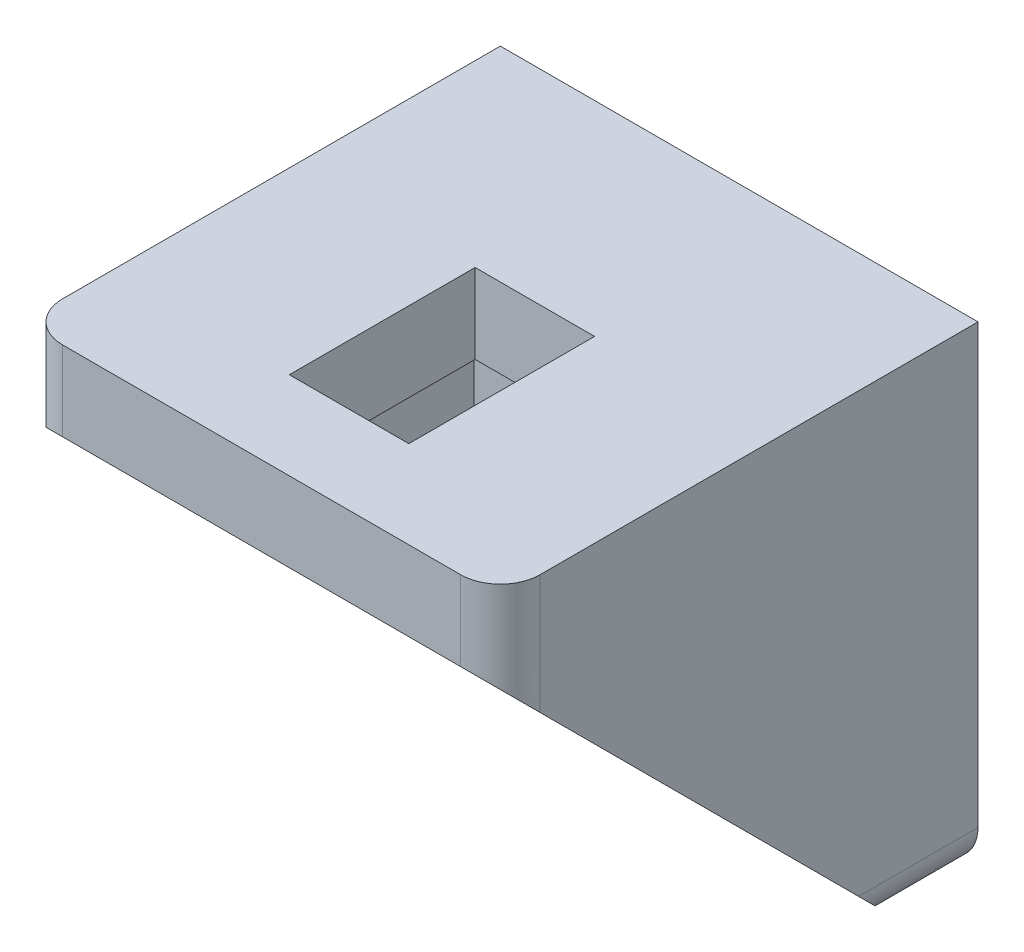
ISO-10303-21;
HEADER;
FILE_DESCRIPTION(('STEP AP214'),'2;1');
FILE_NAME('part.step','',(''),(''),'','','');
FILE_SCHEMA(('AUTOMOTIVE_DESIGN { 1 0 10303 214 1 1 1 1 }'));
ENDSEC;
DATA;
#1=APPLICATION_CONTEXT('core data for automotive mechanical design processes');
#2=APPLICATION_PROTOCOL_DEFINITION('international standard','automotive_design',2000,#1);
#3=PRODUCT_CONTEXT('',#1,'mechanical');
#4=PRODUCT('Part','Part','',(#3));
#5=PRODUCT_RELATED_PRODUCT_CATEGORY('part','',(#4));
#6=PRODUCT_DEFINITION_FORMATION('','',#4);
#7=PRODUCT_DEFINITION_CONTEXT('part definition',#1,'design');
#8=PRODUCT_DEFINITION('design','',#6,#7);
#9=PRODUCT_DEFINITION_SHAPE('','',#8);
#10=(LENGTH_UNIT() NAMED_UNIT(*) SI_UNIT(.MILLI.,.METRE.));
#11=(NAMED_UNIT(*) PLANE_ANGLE_UNIT() SI_UNIT($,.RADIAN.));
#12=(NAMED_UNIT(*) SI_UNIT($,.STERADIAN.) SOLID_ANGLE_UNIT());
#13=UNCERTAINTY_MEASURE_WITH_UNIT(LENGTH_MEASURE(1.E-05),#10,'distance_accuracy_value','');
#14=(GEOMETRIC_REPRESENTATION_CONTEXT(3) GLOBAL_UNCERTAINTY_ASSIGNED_CONTEXT((#13)) GLOBAL_UNIT_ASSIGNED_CONTEXT((#10,
#11,#12)) REPRESENTATION_CONTEXT('',''));
#15=CARTESIAN_POINT('',(0.,0.,0.));
#16=DIRECTION('',(0.,0.,1.));
#17=DIRECTION('',(1.,0.,0.));
#18=AXIS2_PLACEMENT_3D('',#15,#16,#17);
#19=CARTESIAN_POINT('',(7.,0.,0.));
#20=DIRECTION('',(-1.,0.,0.));
#21=DIRECTION('',(0.,-1.,0.));
#22=AXIS2_PLACEMENT_3D('',#19,#20,#21);
#23=PLANE('',#22);
#24=DIRECTION('',(0.,1.,0.));
#25=VECTOR('',#24,1.);
#26=CARTESIAN_POINT('',(7.,-3.,3.));
#27=LINE('',#26,#25);
#28=CARTESIAN_POINT('',(7.,-3.,3.));
#29=VERTEX_POINT('',#28);
#30=CARTESIAN_POINT('',(7.,-18.,3.));
#31=VERTEX_POINT('',#30);
#32=EDGE_CURVE('E268',#29,#31,#27,.F.);
#33=ORIENTED_EDGE('',*,*,#32,.T.);
#34=DIRECTION('',(0.,-0.707106781186548,-0.707106781186548));
#35=VECTOR('',#34,1.);
#36=CARTESIAN_POINT('',(7.,-18.,3.));
#37=LINE('',#36,#35);
#38=CARTESIAN_POINT('',(7.,-3.,18.));
#39=VERTEX_POINT('',#38);
#40=EDGE_CURVE('E207',#39,#31,#37,.T.);
#41=ORIENTED_EDGE('',*,*,#40,.F.);
#42=DIRECTION('',(0.,0.,1.));
#43=VECTOR('',#42,1.);
#44=CARTESIAN_POINT('',(7.,-3.,18.));
#45=LINE('',#44,#43);
#46=EDGE_CURVE('E246',#39,#29,#45,.F.);
#47=ORIENTED_EDGE('',*,*,#46,.T.);
#48=EDGE_LOOP('',(#33,#41,#47));
#49=FACE_BOUND('',#48,.T.);
#50=ADVANCED_FACE('F16',(#49),#23,.T.);
#51=CARTESIAN_POINT('',(-7.,-3.,3.));
#52=DIRECTION('',(0.,0.,-1.));
#53=DIRECTION('',(-1.,0.,0.));
#54=AXIS2_PLACEMENT_3D('',#51,#52,#53);
#55=PLANE('',#54);
#56=DIRECTION('',(0.,-1.,0.));
#57=VECTOR('',#56,1.);
#58=CARTESIAN_POINT('',(-2.25,-7.7,3.));
#59=LINE('',#58,#57);
#60=CARTESIAN_POINT('',(-2.25,-14.7,3.));
#61=VERTEX_POINT('',#60);
#62=CARTESIAN_POINT('',(-2.25,-7.7,3.));
#63=VERTEX_POINT('',#62);
#64=EDGE_CURVE('E358',#61,#63,#59,.F.);
#65=ORIENTED_EDGE('',*,*,#64,.T.);
#66=DIRECTION('',(1.,0.,0.));
#67=VECTOR('',#66,1.);
#68=CARTESIAN_POINT('',(2.25,-7.7,3.));
#69=LINE('',#68,#67);
#70=CARTESIAN_POINT('',(2.25,-7.7,3.));
#71=VERTEX_POINT('',#70);
#72=EDGE_CURVE('E283',#63,#71,#69,.T.);
#73=ORIENTED_EDGE('',*,*,#72,.T.);
#74=DIRECTION('',(0.,1.,0.));
#75=VECTOR('',#74,1.);
#76=CARTESIAN_POINT('',(2.25,-14.7,3.));
#77=LINE('',#76,#75);
#78=CARTESIAN_POINT('',(2.25,-14.7,3.));
#79=VERTEX_POINT('',#78);
#80=EDGE_CURVE('E342',#71,#79,#77,.F.);
#81=ORIENTED_EDGE('',*,*,#80,.T.);
#82=DIRECTION('',(1.,0.,0.));
#83=VECTOR('',#82,1.);
#84=CARTESIAN_POINT('',(-2.25,-14.7,3.));
#85=LINE('',#84,#83);
#86=EDGE_CURVE('E352',#79,#61,#85,.F.);
#87=ORIENTED_EDGE('',*,*,#86,.T.);
#88=EDGE_LOOP('',(#65,#73,#81,#87));
#89=FACE_BOUND('',#88,.T.);
#90=DIRECTION('',(1.,0.,0.));
#91=VECTOR('',#90,1.);
#92=CARTESIAN_POINT('',(-7.,-3.,3.));
#93=LINE('',#92,#91);
#94=CARTESIAN_POINT('',(-7.,-3.,3.));
#95=VERTEX_POINT('',#94);
#96=EDGE_CURVE('E249',#29,#95,#93,.F.);
#97=ORIENTED_EDGE('',*,*,#96,.T.);
#98=DIRECTION('',(0.,-1.,0.));
#99=VECTOR('',#98,1.);
#100=CARTESIAN_POINT('',(-7.,0.,3.));
#101=LINE('',#100,#99);
#102=CARTESIAN_POINT('',(-7.00000000000001,-18.,3.));
#103=VERTEX_POINT('',#102);
#104=EDGE_CURVE('E237',#95,#103,#101,.T.);
#105=ORIENTED_EDGE('',*,*,#104,.T.);
#106=DIRECTION('',(1.,0.,0.));
#107=VECTOR('',#106,1.);
#108=CARTESIAN_POINT('',(9.,-18.,3.));
#109=LINE('',#108,#107);
#110=EDGE_CURVE('E279',#31,#103,#109,.F.);
#111=ORIENTED_EDGE('',*,*,#110,.F.);
#112=ORIENTED_EDGE('',*,*,#32,.F.);
#113=EDGE_LOOP('',(#97,#105,#111,#112));
#114=FACE_BOUND('',#113,.T.);
#115=ADVANCED_FACE('F499',(#89,#114),#55,.F.);
#116=CARTESIAN_POINT('',(-7.,0.,0.));
#117=DIRECTION('',(-1.,0.,0.));
#118=DIRECTION('',(0.,-1.,0.));
#119=AXIS2_PLACEMENT_3D('',#116,#117,#118);
#120=PLANE('',#119);
#121=DIRECTION('',(0.,0.,1.));
#122=VECTOR('',#121,1.);
#123=CARTESIAN_POINT('',(-7.,-3.,18.));
#124=LINE('',#123,#122);
#125=CARTESIAN_POINT('',(-7.,-3.,18.));
#126=VERTEX_POINT('',#125);
#127=EDGE_CURVE('E253',#95,#126,#124,.T.);
#128=ORIENTED_EDGE('',*,*,#127,.T.);
#129=DIRECTION('',(0.,-0.707106781186548,-0.707106781186548));
#130=VECTOR('',#129,1.);
#131=CARTESIAN_POINT('',(-7.00000000000001,-18.,3.));
#132=LINE('',#131,#130);
#133=EDGE_CURVE('E258',#103,#126,#132,.F.);
#134=ORIENTED_EDGE('',*,*,#133,.F.);
#135=ORIENTED_EDGE('',*,*,#104,.F.);
#136=EDGE_LOOP('',(#128,#134,#135));
#137=FACE_BOUND('',#136,.T.);
#138=ADVANCED_FACE('F694',(#137),#120,.F.);
#139=CARTESIAN_POINT('',(9.,-18.,3.));
#140=DIRECTION('',(0.,-0.707106781186548,0.707106781186548));
#141=DIRECTION('',(0.,-0.707106781186548,-0.707106781186548));
#142=AXIS2_PLACEMENT_3D('',#139,#140,#141);
#143=PLANE('',#142);
#144=ORIENTED_EDGE('',*,*,#40,.T.);
#145=DIRECTION('',(1.,0.,0.));
#146=VECTOR('',#145,1.);
#147=CARTESIAN_POINT('',(9.,-18.,3.));
#148=LINE('',#147,#146);
#149=CARTESIAN_POINT('',(7.5,-18.,3.));
#150=VERTEX_POINT('',#149);
#151=EDGE_CURVE('E202',#150,#31,#148,.F.);
#152=ORIENTED_EDGE('',*,*,#151,.F.);
#153=CARTESIAN_POINT('',(7.5,-16.5,4.5));
#154=DIRECTION('',(0.,-0.707106781186548,0.707106781186548));
#155=DIRECTION('',(0.,0.707106781186548,0.707106781186548));
#156=AXIS2_PLACEMENT_3D('',#153,#154,#155);
#157=ELLIPSE('',#156,2.12132034355964,1.5);
#158=CARTESIAN_POINT('',(9.,-16.5,4.5));
#159=VERTEX_POINT('',#158);
#160=EDGE_CURVE('E19',#159,#150,#157,.F.);
#161=ORIENTED_EDGE('',*,*,#160,.F.);
#162=DIRECTION('',(0.,0.707106781186548,0.707106781186548));
#163=VECTOR('',#162,1.);
#164=CARTESIAN_POINT('',(9.,-16.5,4.5));
#165=LINE('',#164,#163);
#166=CARTESIAN_POINT('',(9.,-4.5,16.5));
#167=VERTEX_POINT('',#166);
#168=EDGE_CURVE('E199',#159,#167,#165,.T.);
#169=ORIENTED_EDGE('',*,*,#168,.T.);
#170=CARTESIAN_POINT('',(7.5,-4.5,16.5));
#171=DIRECTION('',(0.,-0.707106781186548,0.707106781186548));
#172=DIRECTION('',(0.,0.707106781186548,0.707106781186548));
#173=AXIS2_PLACEMENT_3D('',#170,#171,#172);
#174=ELLIPSE('',#173,2.12132034355964,1.5);
#175=CARTESIAN_POINT('',(7.5,-3.,18.));
#176=VERTEX_POINT('',#175);
#177=EDGE_CURVE('E315',#176,#167,#174,.F.);
#178=ORIENTED_EDGE('',*,*,#177,.F.);
#179=DIRECTION('',(1.,0.,0.));
#180=VECTOR('',#179,1.);
#181=CARTESIAN_POINT('',(9.,-3.,18.));
#182=LINE('',#181,#180);
#183=EDGE_CURVE('E228',#39,#176,#182,.T.);
#184=ORIENTED_EDGE('',*,*,#183,.F.);
#185=EDGE_LOOP('',(#144,#152,#161,#169,#178,#184));
#186=FACE_BOUND('',#185,.T.);
#187=ADVANCED_FACE('F196',(#186),#143,.T.);
#188=CARTESIAN_POINT('',(7.5,-16.5,18.0195001662));
#189=DIRECTION('',(0.,0.,1.));
#190=DIRECTION('',(1.,0.,0.));
#191=AXIS2_PLACEMENT_3D('',#188,#189,#190);
#192=CYLINDRICAL_SURFACE('',#191,1.5);
#193=CARTESIAN_POINT('',(7.5,-16.5,0.));
#194=DIRECTION('',(0.,0.,1.));
#195=DIRECTION('',(1.,0.,0.));
#196=AXIS2_PLACEMENT_3D('',#193,#194,#195);
#197=CIRCLE('',#196,1.5);
#198=CARTESIAN_POINT('',(9.,-16.5,0.));
#199=VERTEX_POINT('',#198);
#200=CARTESIAN_POINT('',(7.5,-18.,0.));
#201=VERTEX_POINT('',#200);
#202=EDGE_CURVE('E212',#199,#201,#197,.F.);
#203=ORIENTED_EDGE('',*,*,#202,.F.);
#204=DIRECTION('',(0.,0.,1.));
#205=VECTOR('',#204,1.);
#206=CARTESIAN_POINT('',(9.,-16.5,0.));
#207=LINE('',#206,#205);
#208=EDGE_CURVE('E209',#199,#159,#207,.T.);
#209=ORIENTED_EDGE('',*,*,#208,.T.);
#210=ORIENTED_EDGE('',*,*,#160,.T.);
#211=DIRECTION('',(0.,0.,1.));
#212=VECTOR('',#211,1.);
#213=CARTESIAN_POINT('',(7.5,-18.,0.));
#214=LINE('',#213,#212);
#215=EDGE_CURVE('E206',#201,#150,#214,.T.);
#216=ORIENTED_EDGE('',*,*,#215,.F.);
#217=EDGE_LOOP('',(#203,#209,#210,#216));
#218=FACE_BOUND('',#217,.T.);
#219=ADVANCED_FACE('F210',(#218),#192,.T.);
#220=CARTESIAN_POINT('',(9.,-18.,0.));
#221=DIRECTION('',(0.,-1.,0.));
#222=DIRECTION('',(1.,0.,0.));
#223=AXIS2_PLACEMENT_3D('',#220,#221,#222);
#224=PLANE('',#223);
#225=DIRECTION('',(1.,0.,0.));
#226=VECTOR('',#225,1.);
#227=CARTESIAN_POINT('',(9.,-18.,3.));
#228=LINE('',#227,#226);
#229=CARTESIAN_POINT('',(-7.50000000000001,-18.,3.));
#230=VERTEX_POINT('',#229);
#231=EDGE_CURVE('E250',#230,#103,#228,.T.);
#232=ORIENTED_EDGE('',*,*,#231,.F.);
#233=DIRECTION('',(0.,0.,-1.));
#234=VECTOR('',#233,1.);
#235=CARTESIAN_POINT('',(-7.5,-18.,-1.5196663662));
#236=LINE('',#235,#234);
#237=CARTESIAN_POINT('',(-7.5,-18.,0.));
#238=VERTEX_POINT('',#237);
#239=EDGE_CURVE('E263',#238,#230,#236,.F.);
#240=ORIENTED_EDGE('',*,*,#239,.F.);
#241=DIRECTION('',(-1.,0.,0.));
#242=VECTOR('',#241,1.);
#243=CARTESIAN_POINT('',(9.,-18.,0.));
#244=LINE('',#243,#242);
#245=EDGE_CURVE('E312',#201,#238,#244,.T.);
#246=ORIENTED_EDGE('',*,*,#245,.F.);
#247=ORIENTED_EDGE('',*,*,#215,.T.);
#248=ORIENTED_EDGE('',*,*,#151,.T.);
#249=ORIENTED_EDGE('',*,*,#110,.T.);
#250=EDGE_LOOP('',(#232,#240,#246,#247,#248,#249));
#251=FACE_BOUND('',#250,.T.);
#252=ADVANCED_FACE('F365',(#251),#224,.T.);
#253=CARTESIAN_POINT('',(2.25,-7.7,3.));
#254=DIRECTION('',(0.,1.,0.));
#255=DIRECTION('',(0.,0.,1.));
#256=AXIS2_PLACEMENT_3D('',#253,#254,#255);
#257=PLANE('',#256);
#258=ORIENTED_EDGE('',*,*,#72,.F.);
#259=DIRECTION('',(0.,0.,1.));
#260=VECTOR('',#259,1.);
#261=CARTESIAN_POINT('',(-2.25,-7.7,3.));
#262=LINE('',#261,#260);
#263=CARTESIAN_POINT('',(-2.25,-7.7,0.));
#264=VERTEX_POINT('',#263);
#265=EDGE_CURVE('E355',#63,#264,#262,.F.);
#266=ORIENTED_EDGE('',*,*,#265,.T.);
#267=DIRECTION('',(-1.,0.,0.));
#268=VECTOR('',#267,1.);
#269=CARTESIAN_POINT('',(9.,-7.7,0.));
#270=LINE('',#269,#268);
#271=CARTESIAN_POINT('',(2.25,-7.7,0.));
#272=VERTEX_POINT('',#271);
#273=EDGE_CURVE('E311',#272,#264,#270,.T.);
#274=ORIENTED_EDGE('',*,*,#273,.F.);
#275=DIRECTION('',(0.,0.,1.));
#276=VECTOR('',#275,1.);
#277=CARTESIAN_POINT('',(2.25,-7.7,3.));
#278=LINE('',#277,#276);
#279=EDGE_CURVE('E345',#272,#71,#278,.T.);
#280=ORIENTED_EDGE('',*,*,#279,.T.);
#281=EDGE_LOOP('',(#258,#266,#274,#280));
#282=FACE_BOUND('',#281,.T.);
#283=ADVANCED_FACE('F491',(#282),#257,.F.);
#284=CARTESIAN_POINT('',(-2.25,-7.7,3.));
#285=DIRECTION('',(-1.,0.,0.));
#286=DIRECTION('',(0.,-1.,0.));
#287=AXIS2_PLACEMENT_3D('',#284,#285,#286);
#288=PLANE('',#287);
#289=ORIENTED_EDGE('',*,*,#64,.F.);
#290=DIRECTION('',(0.,0.,1.));
#291=VECTOR('',#290,1.);
#292=CARTESIAN_POINT('',(-2.25,-14.7,3.));
#293=LINE('',#292,#291);
#294=CARTESIAN_POINT('',(-2.25,-14.7,0.));
#295=VERTEX_POINT('',#294);
#296=EDGE_CURVE('E349',#61,#295,#293,.F.);
#297=ORIENTED_EDGE('',*,*,#296,.T.);
#298=DIRECTION('',(0.,1.,0.));
#299=VECTOR('',#298,1.);
#300=CARTESIAN_POINT('',(-2.25,0.,0.));
#301=LINE('',#300,#299);
#302=EDGE_CURVE('E479',#264,#295,#301,.F.);
#303=ORIENTED_EDGE('',*,*,#302,.F.);
#304=ORIENTED_EDGE('',*,*,#265,.F.);
#305=EDGE_LOOP('',(#289,#297,#303,#304));
#306=FACE_BOUND('',#305,.T.);
#307=ADVANCED_FACE('F507',(#306),#288,.F.);
#308=CARTESIAN_POINT('',(-2.25,-14.7,3.));
#309=DIRECTION('',(0.,-1.,0.));
#310=DIRECTION('',(1.,0.,0.));
#311=AXIS2_PLACEMENT_3D('',#308,#309,#310);
#312=PLANE('',#311);
#313=ORIENTED_EDGE('',*,*,#86,.F.);
#314=DIRECTION('',(0.,0.,1.));
#315=VECTOR('',#314,1.);
#316=CARTESIAN_POINT('',(2.25,-14.7,3.));
#317=LINE('',#316,#315);
#318=CARTESIAN_POINT('',(2.25,-14.7,0.));
#319=VERTEX_POINT('',#318);
#320=EDGE_CURVE('E335',#79,#319,#317,.F.);
#321=ORIENTED_EDGE('',*,*,#320,.T.);
#322=DIRECTION('',(-1.,0.,0.));
#323=VECTOR('',#322,1.);
#324=CARTESIAN_POINT('',(9.,-14.7,0.));
#325=LINE('',#324,#323);
#326=EDGE_CURVE('E475',#295,#319,#325,.F.);
#327=ORIENTED_EDGE('',*,*,#326,.F.);
#328=ORIENTED_EDGE('',*,*,#296,.F.);
#329=EDGE_LOOP('',(#313,#321,#327,#328));
#330=FACE_BOUND('',#329,.T.);
#331=ADVANCED_FACE('F504',(#330),#312,.F.);
#332=CARTESIAN_POINT('',(2.25,-14.7,3.));
#333=DIRECTION('',(1.,0.,0.));
#334=DIRECTION('',(0.,1.,0.));
#335=AXIS2_PLACEMENT_3D('',#332,#333,#334);
#336=PLANE('',#335);
#337=ORIENTED_EDGE('',*,*,#80,.F.);
#338=ORIENTED_EDGE('',*,*,#279,.F.);
#339=DIRECTION('',(0.,1.,0.));
#340=VECTOR('',#339,1.);
#341=CARTESIAN_POINT('',(2.25,0.,0.));
#342=LINE('',#341,#340);
#343=EDGE_CURVE('E398',#319,#272,#342,.T.);
#344=ORIENTED_EDGE('',*,*,#343,.F.);
#345=ORIENTED_EDGE('',*,*,#320,.F.);
#346=EDGE_LOOP('',(#337,#338,#344,#345));
#347=FACE_BOUND('',#346,.T.);
#348=ADVANCED_FACE('F495',(#347),#336,.F.);
#349=CARTESIAN_POINT('',(-7.5,-16.5,-1.5196663662));
#350=DIRECTION('',(0.,0.,-1.));
#351=DIRECTION('',(-1.,0.,0.));
#352=AXIS2_PLACEMENT_3D('',#349,#350,#351);
#353=CYLINDRICAL_SURFACE('',#352,1.5);
#354=CARTESIAN_POINT('',(-7.5,-16.5,4.5));
#355=DIRECTION('',(0.,-0.707106781186548,0.707106781186548));
#356=DIRECTION('',(0.,-0.707106781186548,-0.707106781186548));
#357=AXIS2_PLACEMENT_3D('',#354,#355,#356);
#358=ELLIPSE('',#357,2.12132034355964,1.5);
#359=CARTESIAN_POINT('',(-9.,-16.5,4.5));
#360=VERTEX_POINT('',#359);
#361=EDGE_CURVE('E262',#360,#230,#358,.T.);
#362=ORIENTED_EDGE('',*,*,#361,.F.);
#363=DIRECTION('',(0.,0.,1.));
#364=VECTOR('',#363,1.);
#365=CARTESIAN_POINT('',(-9.,-16.5,0.));
#366=LINE('',#365,#364);
#367=CARTESIAN_POINT('',(-9.,-16.5,0.));
#368=VERTEX_POINT('',#367);
#369=EDGE_CURVE('E307',#368,#360,#366,.T.);
#370=ORIENTED_EDGE('',*,*,#369,.F.);
#371=CARTESIAN_POINT('',(-7.5,-16.5,0.));
#372=DIRECTION('',(0.,0.,-1.));
#373=DIRECTION('',(-1.,0.,0.));
#374=AXIS2_PLACEMENT_3D('',#371,#372,#373);
#375=CIRCLE('',#374,1.5);
#376=EDGE_CURVE('E308',#238,#368,#375,.T.);
#377=ORIENTED_EDGE('',*,*,#376,.F.);
#378=ORIENTED_EDGE('',*,*,#239,.T.);
#379=EDGE_LOOP('',(#362,#370,#377,#378));
#380=FACE_BOUND('',#379,.T.);
#381=ADVANCED_FACE('F557',(#380),#353,.T.);
#382=CARTESIAN_POINT('',(9.,-18.,3.));
#383=DIRECTION('',(0.,-0.707106781186548,0.707106781186548));
#384=DIRECTION('',(0.,-0.707106781186548,-0.707106781186548));
#385=AXIS2_PLACEMENT_3D('',#382,#383,#384);
#386=PLANE('',#385);
#387=ORIENTED_EDGE('',*,*,#361,.T.);
#388=ORIENTED_EDGE('',*,*,#231,.T.);
#389=ORIENTED_EDGE('',*,*,#133,.T.);
#390=DIRECTION('',(1.,0.,0.));
#391=VECTOR('',#390,1.);
#392=CARTESIAN_POINT('',(9.,-3.,18.));
#393=LINE('',#392,#391);
#394=CARTESIAN_POINT('',(-7.5,-3.,18.));
#395=VERTEX_POINT('',#394);
#396=EDGE_CURVE('E243',#395,#126,#393,.T.);
#397=ORIENTED_EDGE('',*,*,#396,.F.);
#398=CARTESIAN_POINT('',(-7.5,-4.5,16.5));
#399=DIRECTION('',(0.,-0.707106781186548,0.707106781186548));
#400=DIRECTION('',(0.,-0.707106781186548,-0.707106781186548));
#401=AXIS2_PLACEMENT_3D('',#398,#399,#400);
#402=ELLIPSE('',#401,2.12132034355964,1.5);
#403=CARTESIAN_POINT('',(-9.,-4.5,16.5));
#404=VERTEX_POINT('',#403);
#405=EDGE_CURVE('E302',#404,#395,#402,.F.);
#406=ORIENTED_EDGE('',*,*,#405,.F.);
#407=DIRECTION('',(0.,0.707106781186548,0.707106781186547));
#408=VECTOR('',#407,1.);
#409=CARTESIAN_POINT('',(-9.,-16.5,4.5));
#410=LINE('',#409,#408);
#411=EDGE_CURVE('E395',#360,#404,#410,.T.);
#412=ORIENTED_EDGE('',*,*,#411,.F.);
#413=EDGE_LOOP('',(#387,#388,#389,#397,#406,#412));
#414=FACE_BOUND('',#413,.T.);
#415=ADVANCED_FACE('F406',(#414),#386,.T.);
#416=CARTESIAN_POINT('',(-7.,-3.,18.));
#417=DIRECTION('',(0.,1.,0.));
#418=DIRECTION('',(0.,0.,1.));
#419=AXIS2_PLACEMENT_3D('',#416,#417,#418);
#420=PLANE('',#419);
#421=DIRECTION('',(0.,0.,1.));
#422=VECTOR('',#421,1.);
#423=CARTESIAN_POINT('',(-2.25,-3.,14.7));
#424=LINE('',#423,#422);
#425=CARTESIAN_POINT('',(-2.25,-3.,7.7));
#426=VERTEX_POINT('',#425);
#427=CARTESIAN_POINT('',(-2.25,-3.,14.7));
#428=VERTEX_POINT('',#427);
#429=EDGE_CURVE('E460',#426,#428,#424,.T.);
#430=ORIENTED_EDGE('',*,*,#429,.T.);
#431=DIRECTION('',(1.,0.,0.));
#432=VECTOR('',#431,1.);
#433=CARTESIAN_POINT('',(2.25,-3.,14.7));
#434=LINE('',#433,#432);
#435=CARTESIAN_POINT('',(2.25,-3.,14.7));
#436=VERTEX_POINT('',#435);
#437=EDGE_CURVE('E463',#428,#436,#434,.T.);
#438=ORIENTED_EDGE('',*,*,#437,.T.);
#439=DIRECTION('',(0.,0.,1.));
#440=VECTOR('',#439,1.);
#441=CARTESIAN_POINT('',(2.25,-3.,7.7));
#442=LINE('',#441,#440);
#443=CARTESIAN_POINT('',(2.25,-3.,7.7));
#444=VERTEX_POINT('',#443);
#445=EDGE_CURVE('E444',#436,#444,#442,.F.);
#446=ORIENTED_EDGE('',*,*,#445,.T.);
#447=DIRECTION('',(-1.,0.,0.));
#448=VECTOR('',#447,1.);
#449=CARTESIAN_POINT('',(-2.25,-3.,7.7));
#450=LINE('',#449,#448);
#451=EDGE_CURVE('E454',#444,#426,#450,.T.);
#452=ORIENTED_EDGE('',*,*,#451,.T.);
#453=EDGE_LOOP('',(#430,#438,#446,#452));
#454=FACE_BOUND('',#453,.T.);
#455=ORIENTED_EDGE('',*,*,#96,.F.);
#456=ORIENTED_EDGE('',*,*,#46,.F.);
#457=DIRECTION('',(1.,0.,0.));
#458=VECTOR('',#457,1.);
#459=CARTESIAN_POINT('',(9.,-3.,18.));
#460=LINE('',#459,#458);
#461=EDGE_CURVE('E232',#126,#39,#460,.T.);
#462=ORIENTED_EDGE('',*,*,#461,.F.);
#463=ORIENTED_EDGE('',*,*,#127,.F.);
#464=EDGE_LOOP('',(#455,#456,#462,#463));
#465=FACE_BOUND('',#464,.T.);
#466=ADVANCED_FACE('F414',(#454,#465),#420,.F.);
#467=CARTESIAN_POINT('',(9.,-3.,18.));
#468=DIRECTION('',(0.,0.,1.));
#469=DIRECTION('',(1.,0.,0.));
#470=AXIS2_PLACEMENT_3D('',#467,#468,#469);
#471=PLANE('',#470);
#472=DIRECTION('',(1.,0.,0.));
#473=VECTOR('',#472,1.);
#474=CARTESIAN_POINT('',(9.,0.,18.));
#475=LINE('',#474,#473);
#476=CARTESIAN_POINT('',(-7.5,0.,18.));
#477=VERTEX_POINT('',#476);
#478=CARTESIAN_POINT('',(7.5,0.,18.));
#479=VERTEX_POINT('',#478);
#480=EDGE_CURVE('E301',#477,#479,#475,.T.);
#481=ORIENTED_EDGE('',*,*,#480,.F.);
#482=DIRECTION('',(0.,-1.,0.));
#483=VECTOR('',#482,1.);
#484=CARTESIAN_POINT('',(-7.5,-18.0195002343,18.));
#485=LINE('',#484,#483);
#486=EDGE_CURVE('E306',#395,#477,#485,.F.);
#487=ORIENTED_EDGE('',*,*,#486,.F.);
#488=ORIENTED_EDGE('',*,*,#396,.T.);
#489=ORIENTED_EDGE('',*,*,#461,.T.);
#490=ORIENTED_EDGE('',*,*,#183,.T.);
#491=DIRECTION('',(0.,1.,0.));
#492=VECTOR('',#491,1.);
#493=CARTESIAN_POINT('',(7.5,1.519734538077,18.));
#494=LINE('',#493,#492);
#495=EDGE_CURVE('E231',#479,#176,#494,.F.);
#496=ORIENTED_EDGE('',*,*,#495,.F.);
#497=EDGE_LOOP('',(#481,#487,#488,#489,#490,#496));
#498=FACE_BOUND('',#497,.T.);
#499=ADVANCED_FACE('F403',(#498),#471,.T.);
#500=CARTESIAN_POINT('',(7.5,1.519734538077,16.5));
#501=DIRECTION('',(0.,1.,0.));
#502=DIRECTION('',(-1.,0.,0.));
#503=AXIS2_PLACEMENT_3D('',#500,#501,#502);
#504=CYLINDRICAL_SURFACE('',#503,1.5);
#505=ORIENTED_EDGE('',*,*,#177,.T.);
#506=DIRECTION('',(0.,-1.,0.));
#507=VECTOR('',#506,1.);
#508=CARTESIAN_POINT('',(9.,0.,16.5));
#509=LINE('',#508,#507);
#510=CARTESIAN_POINT('',(9.,0.,16.5));
#511=VERTEX_POINT('',#510);
#512=EDGE_CURVE('E216',#167,#511,#509,.F.);
#513=ORIENTED_EDGE('',*,*,#512,.T.);
#514=CARTESIAN_POINT('',(7.5,0.,16.5));
#515=DIRECTION('',(0.,1.,0.));
#516=DIRECTION('',(-1.,0.,0.));
#517=AXIS2_PLACEMENT_3D('',#514,#515,#516);
#518=CIRCLE('',#517,1.5);
#519=EDGE_CURVE('E296',#479,#511,#518,.T.);
#520=ORIENTED_EDGE('',*,*,#519,.F.);
#521=ORIENTED_EDGE('',*,*,#495,.T.);
#522=EDGE_LOOP('',(#505,#513,#520,#521));
#523=FACE_BOUND('',#522,.T.);
#524=ADVANCED_FACE('F387',(#523),#504,.T.);
#525=CARTESIAN_POINT('',(9.,0.,0.));
#526=DIRECTION('',(-1.,0.,0.));
#527=DIRECTION('',(0.,-1.,0.));
#528=AXIS2_PLACEMENT_3D('',#525,#526,#527);
#529=PLANE('',#528);
#530=ORIENTED_EDGE('',*,*,#208,.F.);
#531=DIRECTION('',(0.,1.,0.));
#532=VECTOR('',#531,1.);
#533=CARTESIAN_POINT('',(9.,0.,0.));
#534=LINE('',#533,#532);
#535=CARTESIAN_POINT('',(9.,0.,0.));
#536=VERTEX_POINT('',#535);
#537=EDGE_CURVE('E221',#536,#199,#534,.F.);
#538=ORIENTED_EDGE('',*,*,#537,.F.);
#539=DIRECTION('',(0.,0.,1.));
#540=VECTOR('',#539,1.);
#541=CARTESIAN_POINT('',(9.,0.,18.));
#542=LINE('',#541,#540);
#543=EDGE_CURVE('E300',#511,#536,#542,.F.);
#544=ORIENTED_EDGE('',*,*,#543,.F.);
#545=ORIENTED_EDGE('',*,*,#512,.F.);
#546=ORIENTED_EDGE('',*,*,#168,.F.);
#547=EDGE_LOOP('',(#530,#538,#544,#545,#546));
#548=FACE_BOUND('',#547,.T.);
#549=ADVANCED_FACE('F218',(#548),#529,.F.);
#550=CARTESIAN_POINT('',(9.,0.,0.));
#551=DIRECTION('',(0.,0.,-1.));
#552=DIRECTION('',(-1.,0.,0.));
#553=AXIS2_PLACEMENT_3D('',#550,#551,#552);
#554=PLANE('',#553);
#555=ORIENTED_EDGE('',*,*,#326,.T.);
#556=ORIENTED_EDGE('',*,*,#343,.T.);
#557=ORIENTED_EDGE('',*,*,#273,.T.);
#558=ORIENTED_EDGE('',*,*,#302,.T.);
#559=EDGE_LOOP('',(#555,#556,#557,#558));
#560=FACE_BOUND('',#559,.T.);
#561=ORIENTED_EDGE('',*,*,#245,.T.);
#562=ORIENTED_EDGE('',*,*,#376,.T.);
#563=DIRECTION('',(0.,-1.,0.));
#564=VECTOR('',#563,1.);
#565=CARTESIAN_POINT('',(-9.,0.,0.));
#566=LINE('',#565,#564);
#567=CARTESIAN_POINT('',(-9.,0.,0.));
#568=VERTEX_POINT('',#567);
#569=EDGE_CURVE('E339',#568,#368,#566,.T.);
#570=ORIENTED_EDGE('',*,*,#569,.F.);
#571=DIRECTION('',(1.,0.,0.));
#572=VECTOR('',#571,1.);
#573=CARTESIAN_POINT('',(9.,0.,0.));
#574=LINE('',#573,#572);
#575=EDGE_CURVE('E376',#536,#568,#574,.F.);
#576=ORIENTED_EDGE('',*,*,#575,.F.);
#577=ORIENTED_EDGE('',*,*,#537,.T.);
#578=ORIENTED_EDGE('',*,*,#202,.T.);
#579=EDGE_LOOP('',(#561,#562,#570,#576,#577,#578));
#580=FACE_BOUND('',#579,.T.);
#581=ADVANCED_FACE('F373',(#560,#580),#554,.T.);
#582=CARTESIAN_POINT('',(-9.,0.,0.));
#583=DIRECTION('',(-1.,0.,0.));
#584=DIRECTION('',(0.,-1.,0.));
#585=AXIS2_PLACEMENT_3D('',#582,#583,#584);
#586=PLANE('',#585);
#587=ORIENTED_EDGE('',*,*,#569,.T.);
#588=ORIENTED_EDGE('',*,*,#369,.T.);
#589=ORIENTED_EDGE('',*,*,#411,.T.);
#590=DIRECTION('',(0.,-1.,0.));
#591=VECTOR('',#590,1.);
#592=CARTESIAN_POINT('',(-9.,-18.0195002343,16.5));
#593=LINE('',#592,#591);
#594=CARTESIAN_POINT('',(-9.,0.,16.5));
#595=VERTEX_POINT('',#594);
#596=EDGE_CURVE('E425',#595,#404,#593,.T.);
#597=ORIENTED_EDGE('',*,*,#596,.F.);
#598=DIRECTION('',(0.,0.,1.));
#599=VECTOR('',#598,1.);
#600=CARTESIAN_POINT('',(-9.,0.,18.));
#601=LINE('',#600,#599);
#602=EDGE_CURVE('E295',#568,#595,#601,.T.);
#603=ORIENTED_EDGE('',*,*,#602,.F.);
#604=EDGE_LOOP('',(#587,#588,#589,#597,#603));
#605=FACE_BOUND('',#604,.T.);
#606=ADVANCED_FACE('F541',(#605),#586,.T.);
#607=CARTESIAN_POINT('',(-7.5,-18.0195002343,16.5));
#608=DIRECTION('',(0.,-1.,0.));
#609=DIRECTION('',(1.,0.,0.));
#610=AXIS2_PLACEMENT_3D('',#607,#608,#609);
#611=CYLINDRICAL_SURFACE('',#610,1.5);
#612=CARTESIAN_POINT('',(-7.5,0.,16.5));
#613=DIRECTION('',(0.,-1.,0.));
#614=DIRECTION('',(1.,0.,0.));
#615=AXIS2_PLACEMENT_3D('',#612,#613,#614);
#616=CIRCLE('',#615,1.5);
#617=EDGE_CURVE('E290',#595,#477,#616,.F.);
#618=ORIENTED_EDGE('',*,*,#617,.F.);
#619=ORIENTED_EDGE('',*,*,#596,.T.);
#620=ORIENTED_EDGE('',*,*,#405,.T.);
#621=ORIENTED_EDGE('',*,*,#486,.T.);
#622=EDGE_LOOP('',(#618,#619,#620,#621));
#623=FACE_BOUND('',#622,.T.);
#624=ADVANCED_FACE('F422',(#623),#611,.T.);
#625=CARTESIAN_POINT('',(2.25,-3.,14.7));
#626=DIRECTION('',(0.,0.,1.));
#627=DIRECTION('',(1.,0.,0.));
#628=AXIS2_PLACEMENT_3D('',#625,#626,#627);
#629=PLANE('',#628);
#630=ORIENTED_EDGE('',*,*,#437,.F.);
#631=DIRECTION('',(0.,-1.,0.));
#632=VECTOR('',#631,1.);
#633=CARTESIAN_POINT('',(-2.25,-3.,14.7));
#634=LINE('',#633,#632);
#635=CARTESIAN_POINT('',(-2.25,0.,14.7));
#636=VERTEX_POINT('',#635);
#637=EDGE_CURVE('E457',#428,#636,#634,.F.);
#638=ORIENTED_EDGE('',*,*,#637,.T.);
#639=DIRECTION('',(1.,0.,0.));
#640=VECTOR('',#639,1.);
#641=CARTESIAN_POINT('',(9.,0.,14.7));
#642=LINE('',#641,#640);
#643=CARTESIAN_POINT('',(2.25,0.,14.7));
#644=VERTEX_POINT('',#643);
#645=EDGE_CURVE('E294',#644,#636,#642,.F.);
#646=ORIENTED_EDGE('',*,*,#645,.F.);
#647=DIRECTION('',(0.,1.,0.));
#648=VECTOR('',#647,1.);
#649=CARTESIAN_POINT('',(2.25,-3.,14.7));
#650=LINE('',#649,#648);
#651=EDGE_CURVE('E447',#644,#436,#650,.F.);
#652=ORIENTED_EDGE('',*,*,#651,.T.);
#653=EDGE_LOOP('',(#630,#638,#646,#652));
#654=FACE_BOUND('',#653,.T.);
#655=ADVANCED_FACE('F534',(#654),#629,.F.);
#656=CARTESIAN_POINT('',(-2.25,-3.,14.7));
#657=DIRECTION('',(-1.,0.,0.));
#658=DIRECTION('',(0.,-1.,0.));
#659=AXIS2_PLACEMENT_3D('',#656,#657,#658);
#660=PLANE('',#659);
#661=ORIENTED_EDGE('',*,*,#429,.F.);
#662=DIRECTION('',(0.,1.,0.));
#663=VECTOR('',#662,1.);
#664=CARTESIAN_POINT('',(-2.25,-3.,7.7));
#665=LINE('',#664,#663);
#666=CARTESIAN_POINT('',(-2.25,0.,7.7));
#667=VERTEX_POINT('',#666);
#668=EDGE_CURVE('E451',#426,#667,#665,.T.);
#669=ORIENTED_EDGE('',*,*,#668,.T.);
#670=DIRECTION('',(0.,0.,1.));
#671=VECTOR('',#670,1.);
#672=CARTESIAN_POINT('',(-2.25,0.,18.));
#673=LINE('',#672,#671);
#674=EDGE_CURVE('E953',#636,#667,#673,.F.);
#675=ORIENTED_EDGE('',*,*,#674,.F.);
#676=ORIENTED_EDGE('',*,*,#637,.F.);
#677=EDGE_LOOP('',(#661,#669,#675,#676));
#678=FACE_BOUND('',#677,.T.);
#679=ADVANCED_FACE('F531',(#678),#660,.F.);
#680=CARTESIAN_POINT('',(-2.25,-3.,7.7));
#681=DIRECTION('',(0.,0.,-1.));
#682=DIRECTION('',(-1.,0.,0.));
#683=AXIS2_PLACEMENT_3D('',#680,#681,#682);
#684=PLANE('',#683);
#685=ORIENTED_EDGE('',*,*,#451,.F.);
#686=DIRECTION('',(0.,1.,0.));
#687=VECTOR('',#686,1.);
#688=CARTESIAN_POINT('',(2.25,-3.,7.7));
#689=LINE('',#688,#687);
#690=CARTESIAN_POINT('',(2.25,0.,7.7));
#691=VERTEX_POINT('',#690);
#692=EDGE_CURVE('E39',#444,#691,#689,.T.);
#693=ORIENTED_EDGE('',*,*,#692,.T.);
#694=DIRECTION('',(1.,0.,0.));
#695=VECTOR('',#694,1.);
#696=CARTESIAN_POINT('',(9.,0.,7.7));
#697=LINE('',#696,#695);
#698=EDGE_CURVE('E26',#667,#691,#697,.T.);
#699=ORIENTED_EDGE('',*,*,#698,.F.);
#700=ORIENTED_EDGE('',*,*,#668,.F.);
#701=EDGE_LOOP('',(#685,#693,#699,#700));
#702=FACE_BOUND('',#701,.T.);
#703=ADVANCED_FACE('F524',(#702),#684,.F.);
#704=CARTESIAN_POINT('',(2.25,-3.,7.7));
#705=DIRECTION('',(1.,0.,0.));
#706=DIRECTION('',(0.,1.,0.));
#707=AXIS2_PLACEMENT_3D('',#704,#705,#706);
#708=PLANE('',#707);
#709=ORIENTED_EDGE('',*,*,#445,.F.);
#710=ORIENTED_EDGE('',*,*,#651,.F.);
#711=DIRECTION('',(0.,0.,1.));
#712=VECTOR('',#711,1.);
#713=CARTESIAN_POINT('',(2.25,0.,18.));
#714=LINE('',#713,#712);
#715=EDGE_CURVE('E11',#691,#644,#714,.T.);
#716=ORIENTED_EDGE('',*,*,#715,.F.);
#717=ORIENTED_EDGE('',*,*,#692,.F.);
#718=EDGE_LOOP('',(#709,#710,#716,#717));
#719=FACE_BOUND('',#718,.T.);
#720=ADVANCED_FACE('F518',(#719),#708,.F.);
#721=CARTESIAN_POINT('',(9.,0.,18.));
#722=DIRECTION('',(0.,1.,0.));
#723=DIRECTION('',(0.,0.,1.));
#724=AXIS2_PLACEMENT_3D('',#721,#722,#723);
#725=PLANE('',#724);
#726=ORIENTED_EDGE('',*,*,#698,.T.);
#727=ORIENTED_EDGE('',*,*,#715,.T.);
#728=ORIENTED_EDGE('',*,*,#645,.T.);
#729=ORIENTED_EDGE('',*,*,#674,.T.);
#730=EDGE_LOOP('',(#726,#727,#728,#729));
#731=FACE_BOUND('',#730,.T.);
#732=ORIENTED_EDGE('',*,*,#602,.T.);
#733=ORIENTED_EDGE('',*,*,#617,.T.);
#734=ORIENTED_EDGE('',*,*,#480,.T.);
#735=ORIENTED_EDGE('',*,*,#519,.T.);
#736=ORIENTED_EDGE('',*,*,#543,.T.);
#737=ORIENTED_EDGE('',*,*,#575,.T.);
#738=EDGE_LOOP('',(#732,#733,#734,#735,#736,#737));
#739=FACE_BOUND('',#738,.T.);
#740=ADVANCED_FACE('F384',(#731,#739),#725,.T.);
#741=CLOSED_SHELL('',(#50,#115,#138,#187,#219,#252,#283,#307,#331,#348,#381,#415,#466,#499,#524,
#549,#581,#606,#624,#655,#679,#703,#720,#740));
#742=MANIFOLD_SOLID_BREP('B1',#741);
#743=ADVANCED_BREP_SHAPE_REPRESENTATION('',(#18,#742),#14);
#744=SHAPE_DEFINITION_REPRESENTATION(#9,#743);
ENDSEC;
END-ISO-10303-21;
